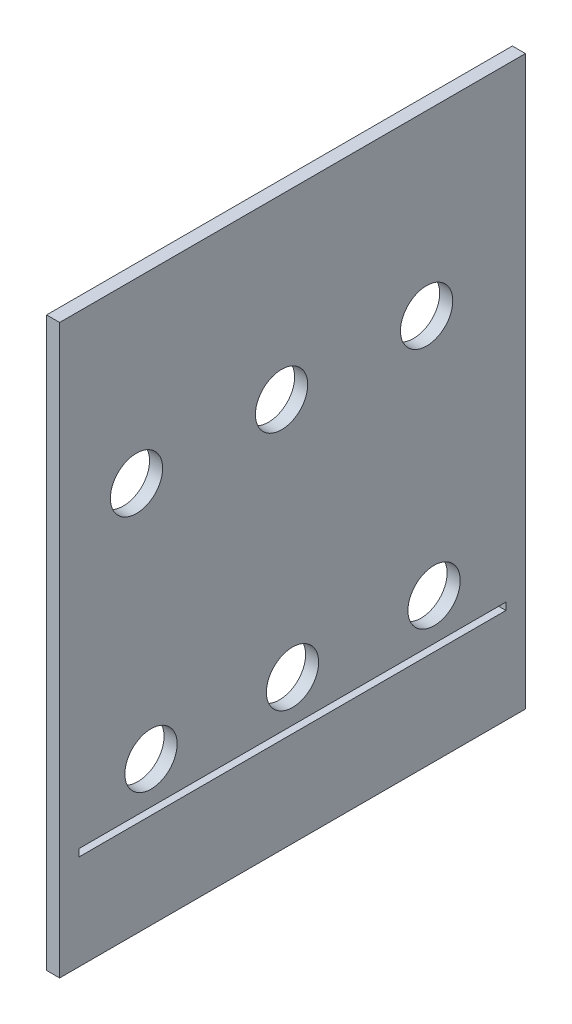
ISO-10303-21;
HEADER;
FILE_DESCRIPTION(('STEP AP214'),'2;1');
FILE_NAME('part.step','',(''),(''),'','','');
FILE_SCHEMA(('AUTOMOTIVE_DESIGN { 1 0 10303 214 1 1 1 1 }'));
ENDSEC;
DATA;
#1=APPLICATION_CONTEXT('core data for automotive mechanical design processes');
#2=APPLICATION_PROTOCOL_DEFINITION('international standard','automotive_design',2000,#1);
#3=PRODUCT_CONTEXT('',#1,'mechanical');
#4=PRODUCT('Part','Part','',(#3));
#5=PRODUCT_RELATED_PRODUCT_CATEGORY('part','',(#4));
#6=PRODUCT_DEFINITION_FORMATION('','',#4);
#7=PRODUCT_DEFINITION_CONTEXT('part definition',#1,'design');
#8=PRODUCT_DEFINITION('design','',#6,#7);
#9=PRODUCT_DEFINITION_SHAPE('','',#8);
#10=(LENGTH_UNIT() NAMED_UNIT(*) SI_UNIT(.MILLI.,.METRE.));
#11=(NAMED_UNIT(*) PLANE_ANGLE_UNIT() SI_UNIT($,.RADIAN.));
#12=(NAMED_UNIT(*) SI_UNIT($,.STERADIAN.) SOLID_ANGLE_UNIT());
#13=UNCERTAINTY_MEASURE_WITH_UNIT(LENGTH_MEASURE(1.E-05),#10,'distance_accuracy_value','');
#14=(GEOMETRIC_REPRESENTATION_CONTEXT(3) GLOBAL_UNCERTAINTY_ASSIGNED_CONTEXT((#13)) GLOBAL_UNIT_ASSIGNED_CONTEXT((#10,
#11,#12)) REPRESENTATION_CONTEXT('',''));
#15=CARTESIAN_POINT('',(0.,0.,0.));
#16=DIRECTION('',(0.,0.,1.));
#17=DIRECTION('',(1.,0.,0.));
#18=AXIS2_PLACEMENT_3D('',#15,#16,#17);
#19=CARTESIAN_POINT('',(0.,329.819,0.));
#20=DIRECTION('',(0.,1.,0.));
#21=DIRECTION('',(0.,0.,1.));
#22=AXIS2_PLACEMENT_3D('',#19,#20,#21);
#23=PLANE('',#22);
#24=DIRECTION('',(-1.,0.,0.));
#25=VECTOR('',#24,1.);
#26=CARTESIAN_POINT('',(-257.175,329.819,-3.175));
#27=LINE('',#26,#25);
#28=CARTESIAN_POINT('',(-257.175,329.819,-3.175));
#29=VERTEX_POINT('',#28);
#30=CARTESIAN_POINT('',(-263.525,329.819,-3.17500000000007));
#31=VERTEX_POINT('',#30);
#32=EDGE_CURVE('E140',#29,#31,#27,.T.);
#33=ORIENTED_EDGE('',*,*,#32,.F.);
#34=DIRECTION('',(0.,0.,1.));
#35=VECTOR('',#34,1.);
#36=CARTESIAN_POINT('',(-257.175,329.819,0.));
#37=LINE('',#36,#35);
#38=CARTESIAN_POINT('',(-257.175,329.819,-229.489));
#39=VERTEX_POINT('',#38);
#40=EDGE_CURVE('E11',#39,#29,#37,.T.);
#41=ORIENTED_EDGE('',*,*,#40,.F.);
#42=DIRECTION('',(-1.,0.,0.));
#43=VECTOR('',#42,1.);
#44=CARTESIAN_POINT('',(-257.175,329.819,-229.489));
#45=LINE('',#44,#43);
#46=CARTESIAN_POINT('',(-263.525,329.819,-229.489));
#47=VERTEX_POINT('',#46);
#48=EDGE_CURVE('E153',#39,#47,#45,.T.);
#49=ORIENTED_EDGE('',*,*,#48,.T.);
#50=DIRECTION('',(0.,0.,-1.));
#51=VECTOR('',#50,1.);
#52=CARTESIAN_POINT('',(-263.525,329.819,-235.839));
#53=LINE('',#52,#51);
#54=EDGE_CURVE('E178',#31,#47,#53,.T.);
#55=ORIENTED_EDGE('',*,*,#54,.F.);
#56=EDGE_LOOP('',(#33,#41,#49,#55));
#57=FACE_BOUND('',#56,.T.);
#58=ADVANCED_FACE('F33',(#57),#23,.T.);
#59=CARTESIAN_POINT('',(-257.175,329.819,0.));
#60=DIRECTION('',(1.,0.,0.));
#61=DIRECTION('',(0.,0.,-1.));
#62=AXIS2_PLACEMENT_3D('',#59,#60,#61);
#63=PLANE('',#62);
#64=DIRECTION('',(0.,1.,0.));
#65=VECTOR('',#64,1.);
#66=CARTESIAN_POINT('',(-257.175,100.205840492243,-12.6585306122447));
#67=LINE('',#66,#65);
#68=CARTESIAN_POINT('',(-257.175,100.205840492243,-12.6585306122447));
#69=VERTEX_POINT('',#68);
#70=CARTESIAN_POINT('',(-257.175,103.733618270021,-12.6585306122447));
#71=VERTEX_POINT('',#70);
#72=EDGE_CURVE('E102',#69,#71,#67,.T.);
#73=ORIENTED_EDGE('',*,*,#72,.T.);
#74=DIRECTION('',(0.,0.,-1.));
#75=VECTOR('',#74,1.);
#76=CARTESIAN_POINT('',(-257.175,103.733618270021,-220.005469387755));
#77=LINE('',#76,#75);
#78=CARTESIAN_POINT('',(-257.175,103.733618270021,-220.005469387755));
#79=VERTEX_POINT('',#78);
#80=EDGE_CURVE('E111',#71,#79,#77,.T.);
#81=ORIENTED_EDGE('',*,*,#80,.T.);
#82=DIRECTION('',(0.,-1.,0.));
#83=VECTOR('',#82,1.);
#84=CARTESIAN_POINT('',(-257.175,100.205840492243,-220.005469387755));
#85=LINE('',#84,#83);
#86=CARTESIAN_POINT('',(-257.175,100.205840492243,-220.005469387755));
#87=VERTEX_POINT('',#86);
#88=EDGE_CURVE('E50',#79,#87,#85,.T.);
#89=ORIENTED_EDGE('',*,*,#88,.T.);
#90=DIRECTION('',(0.,0.,1.));
#91=VECTOR('',#90,1.);
#92=CARTESIAN_POINT('',(-257.175,100.205840492243,-220.005469387755));
#93=LINE('',#92,#91);
#94=EDGE_CURVE('E108',#87,#69,#93,.T.);
#95=ORIENTED_EDGE('',*,*,#94,.T.);
#96=EDGE_LOOP('',(#73,#81,#89,#95));
#97=FACE_BOUND('',#96,.T.);
#98=DIRECTION('',(0.,-1.,0.));
#99=VECTOR('',#98,1.);
#100=CARTESIAN_POINT('',(-257.175,329.819,-3.175));
#101=LINE('',#100,#99);
#102=CARTESIAN_POINT('',(-257.175,53.975,-3.17499999999996));
#103=VERTEX_POINT('',#102);
#104=EDGE_CURVE('E137',#29,#103,#101,.T.);
#105=ORIENTED_EDGE('',*,*,#104,.T.);
#106=DIRECTION('',(0.,0.,1.));
#107=VECTOR('',#106,1.);
#108=CARTESIAN_POINT('',(-257.175,53.975,-229.489));
#109=LINE('',#108,#107);
#110=CARTESIAN_POINT('',(-257.175,53.975,-229.489));
#111=VERTEX_POINT('',#110);
#112=EDGE_CURVE('E36',#111,#103,#109,.T.);
#113=ORIENTED_EDGE('',*,*,#112,.F.);
#114=DIRECTION('',(0.,1.,0.));
#115=VECTOR('',#114,1.);
#116=CARTESIAN_POINT('',(-257.175,329.819,-229.489));
#117=LINE('',#116,#115);
#118=EDGE_CURVE('E147',#111,#39,#117,.T.);
#119=ORIENTED_EDGE('',*,*,#118,.T.);
#120=ORIENTED_EDGE('',*,*,#40,.T.);
#121=EDGE_LOOP('',(#105,#113,#119,#120));
#122=FACE_BOUND('',#121,.T.);
#123=CARTESIAN_POINT('',(-257.175,243.459,-181.483));
#124=DIRECTION('',(1.,0.,0.));
#125=DIRECTION('',(0.,0.,-1.));
#126=AXIS2_PLACEMENT_3D('',#123,#124,#125);
#127=CIRCLE('',#126,12.7);
#128=CARTESIAN_POINT('',(-257.175,243.459,-194.183));
#129=VERTEX_POINT('',#128);
#130=EDGE_CURVE('E181',#129,#129,#127,.F.);
#131=ORIENTED_EDGE('',*,*,#130,.T.);
#132=EDGE_LOOP('',(#131));
#133=FACE_BOUND('',#132,.T.);
#134=CARTESIAN_POINT('',(-257.175,243.459,-110.998));
#135=DIRECTION('',(1.,0.,0.));
#136=DIRECTION('',(0.,0.,-1.));
#137=AXIS2_PLACEMENT_3D('',#134,#135,#136);
#138=CIRCLE('',#137,12.7);
#139=CARTESIAN_POINT('',(-257.175,243.459,-123.698));
#140=VERTEX_POINT('',#139);
#141=EDGE_CURVE('E184',#140,#140,#138,.F.);
#142=ORIENTED_EDGE('',*,*,#141,.T.);
#143=EDGE_LOOP('',(#142));
#144=FACE_BOUND('',#143,.T.);
#145=CARTESIAN_POINT('',(-257.175,243.459,-40.513));
#146=DIRECTION('',(1.,0.,0.));
#147=DIRECTION('',(0.,0.,-1.));
#148=AXIS2_PLACEMENT_3D('',#145,#146,#147);
#149=CIRCLE('',#148,12.7);
#150=CARTESIAN_POINT('',(-257.175,243.459,-53.213));
#151=VERTEX_POINT('',#150);
#152=EDGE_CURVE('E187',#151,#151,#149,.F.);
#153=ORIENTED_EDGE('',*,*,#152,.T.);
#154=EDGE_LOOP('',(#153));
#155=FACE_BOUND('',#154,.T.);
#156=CARTESIAN_POINT('',(-257.175,123.952,-47.5615));
#157=DIRECTION('',(1.,0.,0.));
#158=DIRECTION('',(0.,0.,-1.));
#159=AXIS2_PLACEMENT_3D('',#156,#157,#158);
#160=CIRCLE('',#159,12.7);
#161=CARTESIAN_POINT('',(-257.175,123.952,-60.2615));
#162=VERTEX_POINT('',#161);
#163=EDGE_CURVE('E189',#162,#162,#160,.T.);
#164=ORIENTED_EDGE('',*,*,#163,.F.);
#165=EDGE_LOOP('',(#164));
#166=FACE_BOUND('',#165,.T.);
#167=CARTESIAN_POINT('',(-257.175,123.952,-116.332));
#168=DIRECTION('',(1.,0.,0.));
#169=DIRECTION('',(0.,0.,-1.));
#170=AXIS2_PLACEMENT_3D('',#167,#168,#169);
#171=CIRCLE('',#170,12.7);
#172=CARTESIAN_POINT('',(-257.175,123.952,-129.032));
#173=VERTEX_POINT('',#172);
#174=EDGE_CURVE('E193',#173,#173,#171,.T.);
#175=ORIENTED_EDGE('',*,*,#174,.F.);
#176=EDGE_LOOP('',(#175));
#177=FACE_BOUND('',#176,.T.);
#178=CARTESIAN_POINT('',(-257.175,123.952,-185.1025));
#179=DIRECTION('',(1.,0.,0.));
#180=DIRECTION('',(0.,0.,-1.));
#181=AXIS2_PLACEMENT_3D('',#178,#179,#180);
#182=CIRCLE('',#181,12.7);
#183=CARTESIAN_POINT('',(-257.175,123.952,-197.8025));
#184=VERTEX_POINT('',#183);
#185=EDGE_CURVE('E42',#184,#184,#182,.T.);
#186=ORIENTED_EDGE('',*,*,#185,.F.);
#187=EDGE_LOOP('',(#186));
#188=FACE_BOUND('',#187,.T.);
#189=ADVANCED_FACE('F115',(#97,#122,#133,#144,#155,#166,#177,#188),#63,.T.);
#190=CARTESIAN_POINT('',(0.,123.952,-185.1025));
#191=DIRECTION('',(-1.,0.,0.));
#192=DIRECTION('',(0.,0.,1.));
#193=AXIS2_PLACEMENT_3D('',#190,#191,#192);
#194=CYLINDRICAL_SURFACE('',#193,12.7);
#195=ORIENTED_EDGE('',*,*,#185,.T.);
#196=EDGE_LOOP('',(#195));
#197=FACE_BOUND('',#196,.T.);
#198=CARTESIAN_POINT('',(-263.525,123.952,-185.1025));
#199=DIRECTION('',(-1.,0.,0.));
#200=DIRECTION('',(0.,0.,1.));
#201=AXIS2_PLACEMENT_3D('',#198,#199,#200);
#202=CIRCLE('',#201,12.7);
#203=CARTESIAN_POINT('',(-263.525,123.952,-172.4025));
#204=VERTEX_POINT('',#203);
#205=EDGE_CURVE('E175',#204,#204,#202,.T.);
#206=ORIENTED_EDGE('',*,*,#205,.T.);
#207=EDGE_LOOP('',(#206));
#208=FACE_BOUND('',#207,.T.);
#209=ADVANCED_FACE('F203',(#197,#208),#194,.F.);
#210=CARTESIAN_POINT('',(0.,123.952,-116.332));
#211=DIRECTION('',(-1.,0.,0.));
#212=DIRECTION('',(0.,0.,1.));
#213=AXIS2_PLACEMENT_3D('',#210,#211,#212);
#214=CYLINDRICAL_SURFACE('',#213,12.7);
#215=ORIENTED_EDGE('',*,*,#174,.T.);
#216=EDGE_LOOP('',(#215));
#217=FACE_BOUND('',#216,.T.);
#218=CARTESIAN_POINT('',(-263.525,123.952,-116.332));
#219=DIRECTION('',(-1.,0.,0.));
#220=DIRECTION('',(0.,0.,1.));
#221=AXIS2_PLACEMENT_3D('',#218,#219,#220);
#222=CIRCLE('',#221,12.7);
#223=CARTESIAN_POINT('',(-263.525,123.952,-103.632));
#224=VERTEX_POINT('',#223);
#225=EDGE_CURVE('E172',#224,#224,#222,.T.);
#226=ORIENTED_EDGE('',*,*,#225,.T.);
#227=EDGE_LOOP('',(#226));
#228=FACE_BOUND('',#227,.T.);
#229=ADVANCED_FACE('F210',(#217,#228),#214,.F.);
#230=CARTESIAN_POINT('',(0.,123.952,-47.5615));
#231=DIRECTION('',(-1.,0.,0.));
#232=DIRECTION('',(0.,0.,1.));
#233=AXIS2_PLACEMENT_3D('',#230,#231,#232);
#234=CYLINDRICAL_SURFACE('',#233,12.7);
#235=ORIENTED_EDGE('',*,*,#163,.T.);
#236=EDGE_LOOP('',(#235));
#237=FACE_BOUND('',#236,.T.);
#238=CARTESIAN_POINT('',(-263.525,123.952,-47.5615));
#239=DIRECTION('',(-1.,0.,0.));
#240=DIRECTION('',(0.,0.,1.));
#241=AXIS2_PLACEMENT_3D('',#238,#239,#240);
#242=CIRCLE('',#241,12.7);
#243=CARTESIAN_POINT('',(-263.525,123.952,-34.8615));
#244=VERTEX_POINT('',#243);
#245=EDGE_CURVE('E169',#244,#244,#242,.T.);
#246=ORIENTED_EDGE('',*,*,#245,.T.);
#247=EDGE_LOOP('',(#246));
#248=FACE_BOUND('',#247,.T.);
#249=ADVANCED_FACE('F198',(#237,#248),#234,.F.);
#250=CARTESIAN_POINT('',(0.000999999999973245,243.459,-40.513));
#251=DIRECTION('',(-1.,0.,0.));
#252=DIRECTION('',(0.,0.,1.));
#253=AXIS2_PLACEMENT_3D('',#250,#251,#252);
#254=CYLINDRICAL_SURFACE('',#253,12.7);
#255=ORIENTED_EDGE('',*,*,#152,.F.);
#256=EDGE_LOOP('',(#255));
#257=FACE_BOUND('',#256,.T.);
#258=CARTESIAN_POINT('',(-263.525,243.459,-40.513));
#259=DIRECTION('',(-1.,0.,0.));
#260=DIRECTION('',(0.,0.,1.));
#261=AXIS2_PLACEMENT_3D('',#258,#259,#260);
#262=CIRCLE('',#261,12.7);
#263=CARTESIAN_POINT('',(-263.525,243.459,-27.813));
#264=VERTEX_POINT('',#263);
#265=EDGE_CURVE('E160',#264,#264,#262,.T.);
#266=ORIENTED_EDGE('',*,*,#265,.T.);
#267=EDGE_LOOP('',(#266));
#268=FACE_BOUND('',#267,.T.);
#269=ADVANCED_FACE('F352',(#257,#268),#254,.F.);
#270=CARTESIAN_POINT('',(0.000999999999973245,243.459,-110.998));
#271=DIRECTION('',(-1.,0.,0.));
#272=DIRECTION('',(0.,0.,1.));
#273=AXIS2_PLACEMENT_3D('',#270,#271,#272);
#274=CYLINDRICAL_SURFACE('',#273,12.7);
#275=ORIENTED_EDGE('',*,*,#141,.F.);
#276=EDGE_LOOP('',(#275));
#277=FACE_BOUND('',#276,.T.);
#278=CARTESIAN_POINT('',(-263.525,243.459,-110.998));
#279=DIRECTION('',(-1.,0.,0.));
#280=DIRECTION('',(0.,0.,1.));
#281=AXIS2_PLACEMENT_3D('',#278,#279,#280);
#282=CIRCLE('',#281,12.7);
#283=CARTESIAN_POINT('',(-263.525,243.459,-98.298));
#284=VERTEX_POINT('',#283);
#285=EDGE_CURVE('E163',#284,#284,#282,.T.);
#286=ORIENTED_EDGE('',*,*,#285,.T.);
#287=EDGE_LOOP('',(#286));
#288=FACE_BOUND('',#287,.T.);
#289=ADVANCED_FACE('F363',(#277,#288),#274,.F.);
#290=CARTESIAN_POINT('',(0.000999999999973245,243.459,-181.483));
#291=DIRECTION('',(-1.,0.,0.));
#292=DIRECTION('',(0.,0.,1.));
#293=AXIS2_PLACEMENT_3D('',#290,#291,#292);
#294=CYLINDRICAL_SURFACE('',#293,12.7);
#295=ORIENTED_EDGE('',*,*,#130,.F.);
#296=EDGE_LOOP('',(#295));
#297=FACE_BOUND('',#296,.T.);
#298=CARTESIAN_POINT('',(-263.525,243.459,-181.483));
#299=DIRECTION('',(-1.,0.,0.));
#300=DIRECTION('',(0.,0.,1.));
#301=AXIS2_PLACEMENT_3D('',#298,#299,#300);
#302=CIRCLE('',#301,12.7);
#303=CARTESIAN_POINT('',(-263.525,243.459,-168.783));
#304=VERTEX_POINT('',#303);
#305=EDGE_CURVE('E166',#304,#304,#302,.T.);
#306=ORIENTED_EDGE('',*,*,#305,.T.);
#307=EDGE_LOOP('',(#306));
#308=FACE_BOUND('',#307,.T.);
#309=ADVANCED_FACE('F227',(#297,#308),#294,.F.);
#310=CARTESIAN_POINT('',(-257.175,53.975,-229.489));
#311=DIRECTION('',(0.,-1.,0.));
#312=DIRECTION('',(0.,0.,-1.));
#313=AXIS2_PLACEMENT_3D('',#310,#311,#312);
#314=PLANE('',#313);
#315=DIRECTION('',(-1.,0.,0.));
#316=VECTOR('',#315,1.);
#317=CARTESIAN_POINT('',(-257.175,53.975,-3.17499999999996));
#318=LINE('',#317,#316);
#319=CARTESIAN_POINT('',(-263.525,53.975,-3.17499999999996));
#320=VERTEX_POINT('',#319);
#321=EDGE_CURVE('E142',#103,#320,#318,.T.);
#322=ORIENTED_EDGE('',*,*,#321,.T.);
#323=DIRECTION('',(0.,0.,1.));
#324=VECTOR('',#323,1.);
#325=CARTESIAN_POINT('',(-263.525,53.975,-229.489));
#326=LINE('',#325,#324);
#327=CARTESIAN_POINT('',(-263.525,53.975,-229.489));
#328=VERTEX_POINT('',#327);
#329=EDGE_CURVE('E156',#328,#320,#326,.T.);
#330=ORIENTED_EDGE('',*,*,#329,.F.);
#331=DIRECTION('',(-1.,0.,0.));
#332=VECTOR('',#331,1.);
#333=CARTESIAN_POINT('',(-257.175,53.975,-229.489));
#334=LINE('',#333,#332);
#335=EDGE_CURVE('E150',#111,#328,#334,.T.);
#336=ORIENTED_EDGE('',*,*,#335,.F.);
#337=ORIENTED_EDGE('',*,*,#112,.T.);
#338=EDGE_LOOP('',(#322,#330,#336,#337));
#339=FACE_BOUND('',#338,.T.);
#340=ADVANCED_FACE('F217',(#339),#314,.T.);
#341=CARTESIAN_POINT('',(-263.525,329.819,-235.839));
#342=DIRECTION('',(-1.,0.,0.));
#343=DIRECTION('',(0.,0.,1.));
#344=AXIS2_PLACEMENT_3D('',#341,#342,#343);
#345=PLANE('',#344);
#346=DIRECTION('',(0.,1.,0.));
#347=VECTOR('',#346,1.);
#348=CARTESIAN_POINT('',(-263.525,100.205840492243,-12.6585306122447));
#349=LINE('',#348,#347);
#350=CARTESIAN_POINT('',(-263.525,100.205840492243,-12.6585306122447));
#351=VERTEX_POINT('',#350);
#352=CARTESIAN_POINT('',(-263.525,103.733618270021,-12.6585306122447));
#353=VERTEX_POINT('',#352);
#354=EDGE_CURVE('E58',#351,#353,#349,.T.);
#355=ORIENTED_EDGE('',*,*,#354,.F.);
#356=DIRECTION('',(0.,0.,1.));
#357=VECTOR('',#356,1.);
#358=CARTESIAN_POINT('',(-263.525,100.205840492243,-220.005469387755));
#359=LINE('',#358,#357);
#360=CARTESIAN_POINT('',(-263.525,100.205840492243,-220.005469387755));
#361=VERTEX_POINT('',#360);
#362=EDGE_CURVE('E118',#361,#351,#359,.T.);
#363=ORIENTED_EDGE('',*,*,#362,.F.);
#364=DIRECTION('',(0.,-1.,0.));
#365=VECTOR('',#364,1.);
#366=CARTESIAN_POINT('',(-263.525,100.205840492243,-220.005469387755));
#367=LINE('',#366,#365);
#368=CARTESIAN_POINT('',(-263.525,103.733618270021,-220.005469387755));
#369=VERTEX_POINT('',#368);
#370=EDGE_CURVE('E121',#369,#361,#367,.T.);
#371=ORIENTED_EDGE('',*,*,#370,.F.);
#372=DIRECTION('',(0.,0.,-1.));
#373=VECTOR('',#372,1.);
#374=CARTESIAN_POINT('',(-263.525,103.733618270021,-220.005469387755));
#375=LINE('',#374,#373);
#376=EDGE_CURVE('E127',#353,#369,#375,.T.);
#377=ORIENTED_EDGE('',*,*,#376,.F.);
#378=EDGE_LOOP('',(#355,#363,#371,#377));
#379=FACE_BOUND('',#378,.T.);
#380=DIRECTION('',(0.,-1.,0.));
#381=VECTOR('',#380,1.);
#382=CARTESIAN_POINT('',(-263.525,329.819,-3.175));
#383=LINE('',#382,#381);
#384=EDGE_CURVE('E133',#31,#320,#383,.T.);
#385=ORIENTED_EDGE('',*,*,#384,.F.);
#386=ORIENTED_EDGE('',*,*,#54,.T.);
#387=DIRECTION('',(0.,1.,0.));
#388=VECTOR('',#387,1.);
#389=CARTESIAN_POINT('',(-263.525,329.819,-229.489));
#390=LINE('',#389,#388);
#391=EDGE_CURVE('E145',#328,#47,#390,.T.);
#392=ORIENTED_EDGE('',*,*,#391,.F.);
#393=ORIENTED_EDGE('',*,*,#329,.T.);
#394=EDGE_LOOP('',(#385,#386,#392,#393));
#395=FACE_BOUND('',#394,.T.);
#396=ORIENTED_EDGE('',*,*,#265,.F.);
#397=EDGE_LOOP('',(#396));
#398=FACE_BOUND('',#397,.T.);
#399=ORIENTED_EDGE('',*,*,#285,.F.);
#400=EDGE_LOOP('',(#399));
#401=FACE_BOUND('',#400,.T.);
#402=ORIENTED_EDGE('',*,*,#305,.F.);
#403=EDGE_LOOP('',(#402));
#404=FACE_BOUND('',#403,.T.);
#405=ORIENTED_EDGE('',*,*,#245,.F.);
#406=EDGE_LOOP('',(#405));
#407=FACE_BOUND('',#406,.T.);
#408=ORIENTED_EDGE('',*,*,#225,.F.);
#409=EDGE_LOOP('',(#408));
#410=FACE_BOUND('',#409,.T.);
#411=ORIENTED_EDGE('',*,*,#205,.F.);
#412=EDGE_LOOP('',(#411));
#413=FACE_BOUND('',#412,.T.);
#414=ADVANCED_FACE('F214',(#379,#395,#398,#401,#404,#407,#410,#413),#345,.T.);
#415=CARTESIAN_POINT('',(-257.175,329.819,-229.489));
#416=DIRECTION('',(0.,0.,1.));
#417=DIRECTION('',(1.,0.,0.));
#418=AXIS2_PLACEMENT_3D('',#415,#416,#417);
#419=PLANE('',#418);
#420=ORIENTED_EDGE('',*,*,#391,.T.);
#421=ORIENTED_EDGE('',*,*,#48,.F.);
#422=ORIENTED_EDGE('',*,*,#118,.F.);
#423=ORIENTED_EDGE('',*,*,#335,.T.);
#424=EDGE_LOOP('',(#420,#421,#422,#423));
#425=FACE_BOUND('',#424,.T.);
#426=ADVANCED_FACE('F216',(#425),#419,.F.);
#427=CARTESIAN_POINT('',(-257.175,329.819,-3.175));
#428=DIRECTION('',(0.,0.,-1.));
#429=DIRECTION('',(-1.,0.,0.));
#430=AXIS2_PLACEMENT_3D('',#427,#428,#429);
#431=PLANE('',#430);
#432=ORIENTED_EDGE('',*,*,#384,.T.);
#433=ORIENTED_EDGE('',*,*,#321,.F.);
#434=ORIENTED_EDGE('',*,*,#104,.F.);
#435=ORIENTED_EDGE('',*,*,#32,.T.);
#436=EDGE_LOOP('',(#432,#433,#434,#435));
#437=FACE_BOUND('',#436,.T.);
#438=ADVANCED_FACE('F224',(#437),#431,.F.);
#439=CARTESIAN_POINT('',(-257.175,100.205840492243,-12.6585306122447));
#440=DIRECTION('',(0.,0.,1.));
#441=DIRECTION('',(1.,0.,0.));
#442=AXIS2_PLACEMENT_3D('',#439,#440,#441);
#443=PLANE('',#442);
#444=ORIENTED_EDGE('',*,*,#354,.T.);
#445=DIRECTION('',(-1.,0.,0.));
#446=VECTOR('',#445,1.);
#447=CARTESIAN_POINT('',(-257.175,103.733618270021,-12.6585306122447));
#448=LINE('',#447,#446);
#449=EDGE_CURVE('E98',#71,#353,#448,.T.);
#450=ORIENTED_EDGE('',*,*,#449,.F.);
#451=ORIENTED_EDGE('',*,*,#72,.F.);
#452=DIRECTION('',(-1.,0.,0.));
#453=VECTOR('',#452,1.);
#454=CARTESIAN_POINT('',(-257.175,100.205840492243,-12.6585306122447));
#455=LINE('',#454,#453);
#456=EDGE_CURVE('E131',#69,#351,#455,.T.);
#457=ORIENTED_EDGE('',*,*,#456,.T.);
#458=EDGE_LOOP('',(#444,#450,#451,#457));
#459=FACE_BOUND('',#458,.T.);
#460=ADVANCED_FACE('F100',(#459),#443,.F.);
#461=CARTESIAN_POINT('',(-257.175,100.205840492243,-220.005469387755));
#462=DIRECTION('',(0.,-1.,0.));
#463=DIRECTION('',(0.,0.,-1.));
#464=AXIS2_PLACEMENT_3D('',#461,#462,#463);
#465=PLANE('',#464);
#466=ORIENTED_EDGE('',*,*,#362,.T.);
#467=ORIENTED_EDGE('',*,*,#456,.F.);
#468=ORIENTED_EDGE('',*,*,#94,.F.);
#469=DIRECTION('',(-1.,0.,0.));
#470=VECTOR('',#469,1.);
#471=CARTESIAN_POINT('',(-257.175,100.205840492243,-220.005469387755));
#472=LINE('',#471,#470);
#473=EDGE_CURVE('E134',#87,#361,#472,.T.);
#474=ORIENTED_EDGE('',*,*,#473,.T.);
#475=EDGE_LOOP('',(#466,#467,#468,#474));
#476=FACE_BOUND('',#475,.T.);
#477=ADVANCED_FACE('F252',(#476),#465,.F.);
#478=CARTESIAN_POINT('',(-257.175,100.205840492243,-220.005469387755));
#479=DIRECTION('',(0.,0.,-1.));
#480=DIRECTION('',(-1.,0.,0.));
#481=AXIS2_PLACEMENT_3D('',#478,#479,#480);
#482=PLANE('',#481);
#483=ORIENTED_EDGE('',*,*,#370,.T.);
#484=ORIENTED_EDGE('',*,*,#473,.F.);
#485=ORIENTED_EDGE('',*,*,#88,.F.);
#486=DIRECTION('',(-1.,0.,0.));
#487=VECTOR('',#486,1.);
#488=CARTESIAN_POINT('',(-257.175,103.733618270021,-220.005469387755));
#489=LINE('',#488,#487);
#490=EDGE_CURVE('E107',#79,#369,#489,.T.);
#491=ORIENTED_EDGE('',*,*,#490,.T.);
#492=EDGE_LOOP('',(#483,#484,#485,#491));
#493=FACE_BOUND('',#492,.T.);
#494=ADVANCED_FACE('F257',(#493),#482,.F.);
#495=CARTESIAN_POINT('',(-257.175,103.733618270021,-220.005469387755));
#496=DIRECTION('',(0.,1.,0.));
#497=DIRECTION('',(0.,0.,1.));
#498=AXIS2_PLACEMENT_3D('',#495,#496,#497);
#499=PLANE('',#498);
#500=ORIENTED_EDGE('',*,*,#376,.T.);
#501=ORIENTED_EDGE('',*,*,#490,.F.);
#502=ORIENTED_EDGE('',*,*,#80,.F.);
#503=ORIENTED_EDGE('',*,*,#449,.T.);
#504=EDGE_LOOP('',(#500,#501,#502,#503));
#505=FACE_BOUND('',#504,.T.);
#506=ADVANCED_FACE('F112',(#505),#499,.F.);
#507=CLOSED_SHELL('',(#58,#189,#209,#229,#249,#269,#289,#309,#340,#414,#426,#438,#460,#477,#494,#506));
#508=MANIFOLD_SOLID_BREP('B2',#507);
#509=ADVANCED_BREP_SHAPE_REPRESENTATION('',(#18,#508),#14);
#510=SHAPE_DEFINITION_REPRESENTATION(#9,#509);
ENDSEC;
END-ISO-10303-21;
